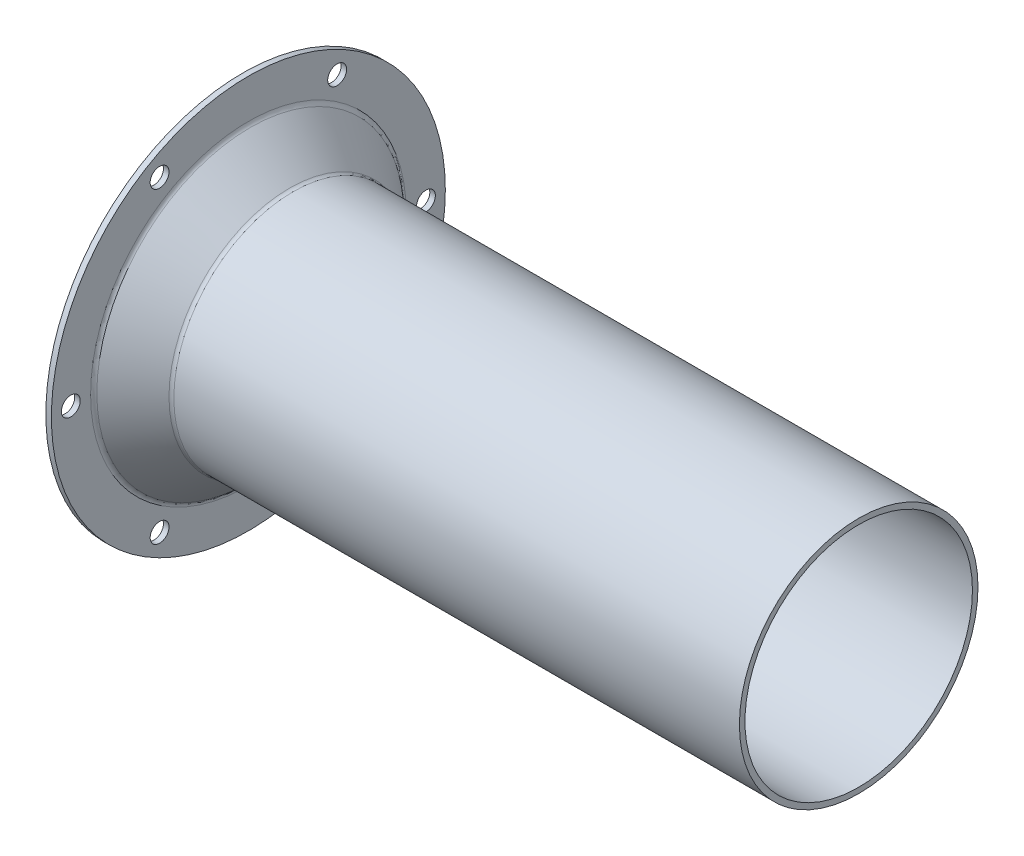
ISO-10303-21;
HEADER;
FILE_DESCRIPTION(('STEP AP214'),'2;1');
FILE_NAME('part.step','',(''),(''),'','','');
FILE_SCHEMA(('AUTOMOTIVE_DESIGN { 1 0 10303 214 1 1 1 1 }'));
ENDSEC;
DATA;
#1=APPLICATION_CONTEXT('core data for automotive mechanical design processes');
#2=APPLICATION_PROTOCOL_DEFINITION('international standard','automotive_design',2000,#1);
#3=PRODUCT_CONTEXT('',#1,'mechanical');
#4=PRODUCT('Part','Part','',(#3));
#5=PRODUCT_RELATED_PRODUCT_CATEGORY('part','',(#4));
#6=PRODUCT_DEFINITION_FORMATION('','',#4);
#7=PRODUCT_DEFINITION_CONTEXT('part definition',#1,'design');
#8=PRODUCT_DEFINITION('design','',#6,#7);
#9=PRODUCT_DEFINITION_SHAPE('','',#8);
#10=(LENGTH_UNIT() NAMED_UNIT(*) SI_UNIT(.MILLI.,.METRE.));
#11=(NAMED_UNIT(*) PLANE_ANGLE_UNIT() SI_UNIT($,.RADIAN.));
#12=(NAMED_UNIT(*) SI_UNIT($,.STERADIAN.) SOLID_ANGLE_UNIT());
#13=UNCERTAINTY_MEASURE_WITH_UNIT(LENGTH_MEASURE(1.E-05),#10,'distance_accuracy_value','');
#14=(GEOMETRIC_REPRESENTATION_CONTEXT(3) GLOBAL_UNCERTAINTY_ASSIGNED_CONTEXT((#13)) GLOBAL_UNIT_ASSIGNED_CONTEXT((#10,
#11,#12)) REPRESENTATION_CONTEXT('',''));
#15=CARTESIAN_POINT('',(0.,0.,0.));
#16=DIRECTION('',(0.,0.,1.));
#17=DIRECTION('',(1.,0.,0.));
#18=AXIS2_PLACEMENT_3D('',#15,#16,#17);
#19=CARTESIAN_POINT('',(0.,0.,0.));
#20=DIRECTION('',(1.,0.,0.));
#21=DIRECTION('',(0.,0.,-1.));
#22=AXIS2_PLACEMENT_3D('',#19,#20,#21);
#23=PLANE('',#22);
#24=CARTESIAN_POINT('',(0.,0.,0.));
#25=DIRECTION('',(-1.,0.,0.));
#26=DIRECTION('',(0.,0.,1.));
#27=AXIS2_PLACEMENT_3D('',#24,#25,#26);
#28=CIRCLE('',#27,28.43261485335);
#29=CARTESIAN_POINT('',(0.,0.,28.432614899646));
#30=VERTEX_POINT('',#29);
#31=CARTESIAN_POINT('',(0.,0.,-28.432614899646));
#32=VERTEX_POINT('',#31);
#33=EDGE_CURVE('E45',#30,#32,#28,.T.);
#34=ORIENTED_EDGE('',*,*,#33,.F.);
#35=CARTESIAN_POINT('',(0.,0.,0.));
#36=DIRECTION('',(-1.,0.,0.));
#37=DIRECTION('',(0.,0.,-1.));
#38=AXIS2_PLACEMENT_3D('',#35,#36,#37);
#39=CIRCLE('',#38,28.43261485335);
#40=EDGE_CURVE('E50',#32,#30,#39,.T.);
#41=ORIENTED_EDGE('',*,*,#40,.F.);
#42=EDGE_LOOP('',(#34,#41));
#43=FACE_BOUND('',#42,.T.);
#44=CARTESIAN_POINT('',(0.,-27.7128129211,-16.));
#45=DIRECTION('',(1.,0.,0.));
#46=DIRECTION('',(0.,0.,-1.));
#47=AXIS2_PLACEMENT_3D('',#44,#45,#46);
#48=CIRCLE('',#47,1.7);
#49=CARTESIAN_POINT('',(0.,-27.7128129211,-17.7));
#50=VERTEX_POINT('',#49);
#51=EDGE_CURVE('E83',#50,#50,#48,.T.);
#52=ORIENTED_EDGE('',*,*,#51,.T.);
#53=EDGE_LOOP('',(#52));
#54=FACE_BOUND('',#53,.T.);
#55=CARTESIAN_POINT('',(0.,0.,-32.));
#56=DIRECTION('',(1.,0.,0.));
#57=DIRECTION('',(0.,0.,-1.));
#58=AXIS2_PLACEMENT_3D('',#55,#56,#57);
#59=CIRCLE('',#58,1.7);
#60=CARTESIAN_POINT('',(0.,0.,-33.7));
#61=VERTEX_POINT('',#60);
#62=EDGE_CURVE('E231',#61,#61,#59,.T.);
#63=ORIENTED_EDGE('',*,*,#62,.T.);
#64=EDGE_LOOP('',(#63));
#65=FACE_BOUND('',#64,.T.);
#66=CARTESIAN_POINT('',(0.,-27.7128129211,16.));
#67=DIRECTION('',(1.,0.,0.));
#68=DIRECTION('',(0.,0.,-1.));
#69=AXIS2_PLACEMENT_3D('',#66,#67,#68);
#70=CIRCLE('',#69,1.7);
#71=CARTESIAN_POINT('',(0.,-27.7128129211,14.3));
#72=VERTEX_POINT('',#71);
#73=EDGE_CURVE('E234',#72,#72,#70,.T.);
#74=ORIENTED_EDGE('',*,*,#73,.T.);
#75=EDGE_LOOP('',(#74));
#76=FACE_BOUND('',#75,.T.);
#77=CARTESIAN_POINT('',(0.,0.,32.));
#78=DIRECTION('',(1.,0.,0.));
#79=DIRECTION('',(0.,0.,-1.));
#80=AXIS2_PLACEMENT_3D('',#77,#78,#79);
#81=CIRCLE('',#80,1.7);
#82=CARTESIAN_POINT('',(0.,0.,30.3));
#83=VERTEX_POINT('',#82);
#84=EDGE_CURVE('E237',#83,#83,#81,.T.);
#85=ORIENTED_EDGE('',*,*,#84,.T.);
#86=EDGE_LOOP('',(#85));
#87=FACE_BOUND('',#86,.T.);
#88=CARTESIAN_POINT('',(0.,27.7128129211,16.));
#89=DIRECTION('',(1.,0.,0.));
#90=DIRECTION('',(0.,0.,-1.));
#91=AXIS2_PLACEMENT_3D('',#88,#89,#90);
#92=CIRCLE('',#91,1.7);
#93=CARTESIAN_POINT('',(0.,27.7128129211,14.3));
#94=VERTEX_POINT('',#93);
#95=EDGE_CURVE('E240',#94,#94,#92,.T.);
#96=ORIENTED_EDGE('',*,*,#95,.T.);
#97=EDGE_LOOP('',(#96));
#98=FACE_BOUND('',#97,.T.);
#99=CARTESIAN_POINT('',(0.,27.7128129211,-16.));
#100=DIRECTION('',(1.,0.,0.));
#101=DIRECTION('',(0.,0.,-1.));
#102=AXIS2_PLACEMENT_3D('',#99,#100,#101);
#103=CIRCLE('',#102,1.7);
#104=CARTESIAN_POINT('',(0.,27.7128129211,-17.7));
#105=VERTEX_POINT('',#104);
#106=EDGE_CURVE('E243',#105,#105,#103,.T.);
#107=ORIENTED_EDGE('',*,*,#106,.T.);
#108=EDGE_LOOP('',(#107));
#109=FACE_BOUND('',#108,.T.);
#110=CARTESIAN_POINT('',(0.,0.,0.));
#111=DIRECTION('',(1.,0.,0.));
#112=DIRECTION('',(0.,0.,-1.));
#113=AXIS2_PLACEMENT_3D('',#110,#111,#112);
#114=CIRCLE('',#113,35.5);
#115=CARTESIAN_POINT('',(0.,0.,-35.5));
#116=VERTEX_POINT('',#115);
#117=EDGE_CURVE('E57',#116,#116,#114,.T.);
#118=ORIENTED_EDGE('',*,*,#117,.F.);
#119=EDGE_LOOP('',(#118));
#120=FACE_BOUND('',#119,.T.);
#121=ADVANCED_FACE('F17',(#43,#54,#65,#76,#87,#98,#109,#120),#23,.F.);
#122=CARTESIAN_POINT('',(2.,0.,0.));
#123=DIRECTION('',(1.,0.,0.));
#124=DIRECTION('',(0.,0.00616046103310393,-0.999981024179889));
#125=AXIS2_PLACEMENT_3D('',#122,#123,#124);
#126=TOROIDAL_SURFACE('',#125,28.43261531631,2.);
#127=ORIENTED_EDGE('',*,*,#33,.T.);
#128=ORIENTED_EDGE('',*,*,#40,.T.);
#129=EDGE_LOOP('',(#127,#128));
#130=FACE_BOUND('',#129,.T.);
#131=CARTESIAN_POINT('',(0.714424995261982,0.,0.));
#132=DIRECTION('',(-1.,0.,0.));
#133=DIRECTION('',(0.,0.,-1.));
#134=AXIS2_PLACEMENT_3D('',#131,#132,#133);
#135=CIRCLE('',#134,26.9005262499696);
#136=CARTESIAN_POINT('',(0.714424995261982,0.,-26.9005262499696));
#137=VERTEX_POINT('',#136);
#138=EDGE_CURVE('E79',#137,#137,#135,.F.);
#139=ORIENTED_EDGE('',*,*,#138,.T.);
#140=EDGE_LOOP('',(#139));
#141=FACE_BOUND('',#140,.T.);
#142=ADVANCED_FACE('F55',(#130,#141),#126,.T.);
#143=CARTESIAN_POINT('',(-5.55,0.,0.));
#144=DIRECTION('',(1.,0.,0.));
#145=DIRECTION('',(0.,0.,-1.));
#146=AXIS2_PLACEMENT_3D('',#143,#144,#145);
#147=CYLINDRICAL_SURFACE('',#146,35.5);
#148=CARTESIAN_POINT('',(1.,0.,0.));
#149=DIRECTION('',(1.,0.,0.));
#150=DIRECTION('',(0.,0.,-1.));
#151=AXIS2_PLACEMENT_3D('',#148,#149,#150);
#152=CIRCLE('',#151,35.5);
#153=CARTESIAN_POINT('',(1.,0.,-35.5));
#154=VERTEX_POINT('',#153);
#155=EDGE_CURVE('E82',#154,#154,#152,.T.);
#156=ORIENTED_EDGE('',*,*,#155,.F.);
#157=EDGE_LOOP('',(#156));
#158=FACE_BOUND('',#157,.T.);
#159=ORIENTED_EDGE('',*,*,#117,.T.);
#160=EDGE_LOOP('',(#159));
#161=FACE_BOUND('',#160,.T.);
#162=ADVANCED_FACE('F74',(#158,#161),#147,.T.);
#163=CARTESIAN_POINT('',(1.,27.7128129211,-16.));
#164=DIRECTION('',(1.,0.,0.));
#165=DIRECTION('',(0.,0.,-1.));
#166=AXIS2_PLACEMENT_3D('',#163,#164,#165);
#167=CYLINDRICAL_SURFACE('',#166,1.7);
#168=CARTESIAN_POINT('',(1.,27.7128129211,-16.));
#169=DIRECTION('',(1.,0.,0.));
#170=DIRECTION('',(0.,0.,-1.));
#171=AXIS2_PLACEMENT_3D('',#168,#169,#170);
#172=CIRCLE('',#171,1.7);
#173=CARTESIAN_POINT('',(1.,27.7128129211,-17.7));
#174=VERTEX_POINT('',#173);
#175=EDGE_CURVE('E224',#174,#174,#172,.F.);
#176=ORIENTED_EDGE('',*,*,#175,.F.);
#177=EDGE_LOOP('',(#176));
#178=FACE_BOUND('',#177,.T.);
#179=ORIENTED_EDGE('',*,*,#106,.F.);
#180=EDGE_LOOP('',(#179));
#181=FACE_BOUND('',#180,.T.);
#182=ADVANCED_FACE('F165',(#178,#181),#167,.F.);
#183=CARTESIAN_POINT('',(1.,27.7128129211,16.));
#184=DIRECTION('',(1.,0.,0.));
#185=DIRECTION('',(0.,0.,-1.));
#186=AXIS2_PLACEMENT_3D('',#183,#184,#185);
#187=CYLINDRICAL_SURFACE('',#186,1.7);
#188=CARTESIAN_POINT('',(1.,27.7128129211,16.));
#189=DIRECTION('',(1.,0.,0.));
#190=DIRECTION('',(0.,0.,-1.));
#191=AXIS2_PLACEMENT_3D('',#188,#189,#190);
#192=CIRCLE('',#191,1.7);
#193=CARTESIAN_POINT('',(1.,27.7128129211,14.3));
#194=VERTEX_POINT('',#193);
#195=EDGE_CURVE('E221',#194,#194,#192,.F.);
#196=ORIENTED_EDGE('',*,*,#195,.F.);
#197=EDGE_LOOP('',(#196));
#198=FACE_BOUND('',#197,.T.);
#199=ORIENTED_EDGE('',*,*,#95,.F.);
#200=EDGE_LOOP('',(#199));
#201=FACE_BOUND('',#200,.T.);
#202=ADVANCED_FACE('F162',(#198,#201),#187,.F.);
#203=CARTESIAN_POINT('',(1.,0.,32.));
#204=DIRECTION('',(1.,0.,0.));
#205=DIRECTION('',(0.,0.,-1.));
#206=AXIS2_PLACEMENT_3D('',#203,#204,#205);
#207=CYLINDRICAL_SURFACE('',#206,1.7);
#208=CARTESIAN_POINT('',(1.,0.,32.));
#209=DIRECTION('',(1.,0.,0.));
#210=DIRECTION('',(0.,0.,-1.));
#211=AXIS2_PLACEMENT_3D('',#208,#209,#210);
#212=CIRCLE('',#211,1.7);
#213=CARTESIAN_POINT('',(1.,0.,30.3));
#214=VERTEX_POINT('',#213);
#215=EDGE_CURVE('E218',#214,#214,#212,.F.);
#216=ORIENTED_EDGE('',*,*,#215,.F.);
#217=EDGE_LOOP('',(#216));
#218=FACE_BOUND('',#217,.T.);
#219=ORIENTED_EDGE('',*,*,#84,.F.);
#220=EDGE_LOOP('',(#219));
#221=FACE_BOUND('',#220,.T.);
#222=ADVANCED_FACE('F158',(#218,#221),#207,.F.);
#223=CARTESIAN_POINT('',(1.,-27.7128129211,16.));
#224=DIRECTION('',(1.,0.,0.));
#225=DIRECTION('',(0.,0.,-1.));
#226=AXIS2_PLACEMENT_3D('',#223,#224,#225);
#227=CYLINDRICAL_SURFACE('',#226,1.7);
#228=CARTESIAN_POINT('',(1.,-27.7128129211,16.));
#229=DIRECTION('',(1.,0.,0.));
#230=DIRECTION('',(0.,0.,-1.));
#231=AXIS2_PLACEMENT_3D('',#228,#229,#230);
#232=CIRCLE('',#231,1.7);
#233=CARTESIAN_POINT('',(1.,-27.7128129211,14.3));
#234=VERTEX_POINT('',#233);
#235=EDGE_CURVE('E215',#234,#234,#232,.F.);
#236=ORIENTED_EDGE('',*,*,#235,.F.);
#237=EDGE_LOOP('',(#236));
#238=FACE_BOUND('',#237,.T.);
#239=ORIENTED_EDGE('',*,*,#73,.F.);
#240=EDGE_LOOP('',(#239));
#241=FACE_BOUND('',#240,.T.);
#242=ADVANCED_FACE('F154',(#238,#241),#227,.F.);
#243=CARTESIAN_POINT('',(1.,0.,-32.));
#244=DIRECTION('',(1.,0.,0.));
#245=DIRECTION('',(0.,0.,-1.));
#246=AXIS2_PLACEMENT_3D('',#243,#244,#245);
#247=CYLINDRICAL_SURFACE('',#246,1.7);
#248=CARTESIAN_POINT('',(1.,0.,-32.));
#249=DIRECTION('',(1.,0.,0.));
#250=DIRECTION('',(0.,0.,-1.));
#251=AXIS2_PLACEMENT_3D('',#248,#249,#250);
#252=CIRCLE('',#251,1.7);
#253=CARTESIAN_POINT('',(1.,0.,-33.7));
#254=VERTEX_POINT('',#253);
#255=EDGE_CURVE('E212',#254,#254,#252,.F.);
#256=ORIENTED_EDGE('',*,*,#255,.F.);
#257=EDGE_LOOP('',(#256));
#258=FACE_BOUND('',#257,.T.);
#259=ORIENTED_EDGE('',*,*,#62,.F.);
#260=EDGE_LOOP('',(#259));
#261=FACE_BOUND('',#260,.T.);
#262=ADVANCED_FACE('F150',(#258,#261),#247,.F.);
#263=CARTESIAN_POINT('',(1.,-27.7128129211,-16.));
#264=DIRECTION('',(1.,0.,0.));
#265=DIRECTION('',(0.,0.,-1.));
#266=AXIS2_PLACEMENT_3D('',#263,#264,#265);
#267=CYLINDRICAL_SURFACE('',#266,1.7);
#268=CARTESIAN_POINT('',(1.,-27.7128129211,-16.));
#269=DIRECTION('',(1.,0.,0.));
#270=DIRECTION('',(0.,0.,-1.));
#271=AXIS2_PLACEMENT_3D('',#268,#269,#270);
#272=CIRCLE('',#271,1.7);
#273=CARTESIAN_POINT('',(1.,-27.7128129211,-17.7));
#274=VERTEX_POINT('',#273);
#275=EDGE_CURVE('E209',#274,#274,#272,.F.);
#276=ORIENTED_EDGE('',*,*,#275,.F.);
#277=EDGE_LOOP('',(#276));
#278=FACE_BOUND('',#277,.T.);
#279=ORIENTED_EDGE('',*,*,#51,.F.);
#280=EDGE_LOOP('',(#279));
#281=FACE_BOUND('',#280,.T.);
#282=ADVANCED_FACE('F146',(#278,#281),#267,.F.);
#283=CARTESIAN_POINT('',(0.714424995261982,0.,0.));
#284=DIRECTION('',(-1.,0.,0.));
#285=DIRECTION('',(0.,0.,1.));
#286=AXIS2_PLACEMENT_3D('',#283,#284,#285);
#287=CONICAL_SURFACE('',#286,26.9005262499696,0.6981317007976);
#288=ORIENTED_EDGE('',*,*,#138,.F.);
#289=EDGE_LOOP('',(#288));
#290=FACE_BOUND('',#289,.T.);
#291=CARTESIAN_POINT('',(7.78464048831248,0.,0.));
#292=DIRECTION('',(1.,0.,0.));
#293=DIRECTION('',(0.,0.00721223015591878,-0.999973991529869));
#294=AXIS2_PLACEMENT_3D('',#291,#292,#293);
#295=CIRCLE('',#294,20.9679110374094);
#296=CARTESIAN_POINT('',(7.78464048831248,0.151225400290626,-20.9673656941215));
#297=VERTEX_POINT('',#296);
#298=EDGE_CURVE('E84',#297,#297,#295,.F.);
#299=ORIENTED_EDGE('',*,*,#298,.F.);
#300=EDGE_LOOP('',(#299));
#301=FACE_BOUND('',#300,.T.);
#302=ADVANCED_FACE('F135',(#290,#301),#287,.F.);
#303=CARTESIAN_POINT('',(1.,0.,0.));
#304=DIRECTION('',(1.,0.,0.));
#305=DIRECTION('',(0.,0.,-1.));
#306=AXIS2_PLACEMENT_3D('',#303,#304,#305);
#307=PLANE('',#306);
#308=CARTESIAN_POINT('',(1.00000000000005,0.,0.));
#309=DIRECTION('',(1.,0.,0.));
#310=DIRECTION('',(0.,0.,-1.));
#311=AXIS2_PLACEMENT_3D('',#308,#309,#310);
#312=CIRCLE('',#311,28.432614995035);
#313=CARTESIAN_POINT('',(1.00000000000006,0.,28.43261480227));
#314=VERTEX_POINT('',#313);
#315=CARTESIAN_POINT('',(1.00000000000006,0.,-28.43261480227));
#316=VERTEX_POINT('',#315);
#317=EDGE_CURVE('E36',#314,#316,#312,.F.);
#318=ORIENTED_EDGE('',*,*,#317,.T.);
#319=CARTESIAN_POINT('',(1.00000000000021,0.,0.));
#320=DIRECTION('',(1.,0.,0.));
#321=DIRECTION('',(0.,0.,1.));
#322=AXIS2_PLACEMENT_3D('',#319,#320,#321);
#323=CIRCLE('',#322,28.43261467376);
#324=EDGE_CURVE('E87',#316,#314,#323,.F.);
#325=ORIENTED_EDGE('',*,*,#324,.T.);
#326=EDGE_LOOP('',(#318,#325));
#327=FACE_BOUND('',#326,.T.);
#328=ORIENTED_EDGE('',*,*,#275,.T.);
#329=EDGE_LOOP('',(#328));
#330=FACE_BOUND('',#329,.T.);
#331=ORIENTED_EDGE('',*,*,#255,.T.);
#332=EDGE_LOOP('',(#331));
#333=FACE_BOUND('',#332,.T.);
#334=ORIENTED_EDGE('',*,*,#235,.T.);
#335=EDGE_LOOP('',(#334));
#336=FACE_BOUND('',#335,.T.);
#337=ORIENTED_EDGE('',*,*,#215,.T.);
#338=EDGE_LOOP('',(#337));
#339=FACE_BOUND('',#338,.T.);
#340=ORIENTED_EDGE('',*,*,#195,.T.);
#341=EDGE_LOOP('',(#340));
#342=FACE_BOUND('',#341,.T.);
#343=ORIENTED_EDGE('',*,*,#175,.T.);
#344=EDGE_LOOP('',(#343));
#345=FACE_BOUND('',#344,.T.);
#346=ORIENTED_EDGE('',*,*,#155,.T.);
#347=EDGE_LOOP('',(#346));
#348=FACE_BOUND('',#347,.T.);
#349=ADVANCED_FACE('F126',(#327,#330,#333,#336,#339,#342,#345,#348),#307,.T.);
#350=CARTESIAN_POINT('',(9.070215616692,0.,0.));
#351=DIRECTION('',(1.,0.,0.));
#352=DIRECTION('',(0.,0.00721223015591877,-0.999973991529869));
#353=AXIS2_PLACEMENT_3D('',#350,#351,#352);
#354=TOROIDAL_SURFACE('',#353,22.5,2.);
#355=ORIENTED_EDGE('',*,*,#298,.T.);
#356=EDGE_LOOP('',(#355));
#357=FACE_BOUND('',#356,.T.);
#358=CARTESIAN_POINT('',(9.070215616692,0.,0.));
#359=DIRECTION('',(1.,0.,0.));
#360=DIRECTION('',(0.,0.,-1.));
#361=AXIS2_PLACEMENT_3D('',#358,#359,#360);
#362=CIRCLE('',#361,20.5);
#363=CARTESIAN_POINT('',(9.070215616692,0.,-20.5));
#364=VERTEX_POINT('',#363);
#365=EDGE_CURVE('E119',#364,#364,#362,.T.);
#366=ORIENTED_EDGE('',*,*,#365,.T.);
#367=EDGE_LOOP('',(#366));
#368=FACE_BOUND('',#367,.T.);
#369=ADVANCED_FACE('F105',(#357,#368),#354,.T.);
#370=CARTESIAN_POINT('',(2.,0.,0.));
#371=DIRECTION('',(1.,0.,0.));
#372=DIRECTION('',(0.,-0.00621704011097389,-0.999980674019382));
#373=AXIS2_PLACEMENT_3D('',#370,#371,#372);
#374=TOROIDAL_SURFACE('',#373,28.43261531631,1.);
#375=CARTESIAN_POINT('',(1.35721269709009,0.,0.));
#376=DIRECTION('',(-1.,0.,0.));
#377=DIRECTION('',(0.,0.,-1.));
#378=AXIS2_PLACEMENT_3D('',#375,#376,#377);
#379=CIRCLE('',#378,27.6665706157689);
#380=CARTESIAN_POINT('',(1.35721269709009,0.,-27.6665706157689));
#381=VERTEX_POINT('',#380);
#382=EDGE_CURVE('E114',#381,#381,#379,.F.);
#383=ORIENTED_EDGE('',*,*,#382,.F.);
#384=EDGE_LOOP('',(#383));
#385=FACE_BOUND('',#384,.T.);
#386=ORIENTED_EDGE('',*,*,#324,.F.);
#387=ORIENTED_EDGE('',*,*,#317,.F.);
#388=EDGE_LOOP('',(#386,#387));
#389=FACE_BOUND('',#388,.T.);
#390=ADVANCED_FACE('F93',(#385,#389),#374,.F.);
#391=CARTESIAN_POINT('',(-5.55,0.,0.));
#392=DIRECTION('',(1.,0.,0.));
#393=DIRECTION('',(0.,0.,-1.));
#394=AXIS2_PLACEMENT_3D('',#391,#392,#393);
#395=CYLINDRICAL_SURFACE('',#394,20.5);
#396=CARTESIAN_POINT('',(111.,0.,0.));
#397=DIRECTION('',(1.,0.,0.));
#398=DIRECTION('',(0.,0.,-1.));
#399=AXIS2_PLACEMENT_3D('',#396,#397,#398);
#400=CIRCLE('',#399,20.5);
#401=CARTESIAN_POINT('',(111.,0.,-20.5));
#402=VERTEX_POINT('',#401);
#403=EDGE_CURVE('E118',#402,#402,#400,.F.);
#404=ORIENTED_EDGE('',*,*,#403,.F.);
#405=EDGE_LOOP('',(#404));
#406=FACE_BOUND('',#405,.T.);
#407=ORIENTED_EDGE('',*,*,#365,.F.);
#408=EDGE_LOOP('',(#407));
#409=FACE_BOUND('',#408,.T.);
#410=ADVANCED_FACE('F104',(#406,#409),#395,.F.);
#411=CARTESIAN_POINT('',(1.35721269709009,0.,0.));
#412=DIRECTION('',(-1.,0.,0.));
#413=DIRECTION('',(0.,0.,1.));
#414=AXIS2_PLACEMENT_3D('',#411,#412,#413);
#415=CONICAL_SURFACE('',#414,27.6665706157689,0.6981317007976);
#416=ORIENTED_EDGE('',*,*,#382,.T.);
#417=EDGE_LOOP('',(#416));
#418=FACE_BOUND('',#417,.T.);
#419=CARTESIAN_POINT('',(8.42742826138858,0.,0.));
#420=DIRECTION('',(1.,0.,0.));
#421=DIRECTION('',(0.,-0.00651687448335113,-0.99997876494802));
#422=AXIS2_PLACEMENT_3D('',#419,#420,#421);
#423=CIRCLE('',#422,21.7339553434283);
#424=CARTESIAN_POINT('',(8.42742826138858,-0.141637458999881,-21.7334938217569));
#425=VERTEX_POINT('',#424);
#426=EDGE_CURVE('E115',#425,#425,#423,.F.);
#427=ORIENTED_EDGE('',*,*,#426,.T.);
#428=EDGE_LOOP('',(#427));
#429=FACE_BOUND('',#428,.T.);
#430=ADVANCED_FACE('F193',(#418,#429),#415,.T.);
#431=CARTESIAN_POINT('',(111.,0.,0.));
#432=DIRECTION('',(1.,0.,0.));
#433=DIRECTION('',(0.,0.,-1.));
#434=AXIS2_PLACEMENT_3D('',#431,#432,#433);
#435=PLANE('',#434);
#436=ORIENTED_EDGE('',*,*,#403,.T.);
#437=EDGE_LOOP('',(#436));
#438=FACE_BOUND('',#437,.T.);
#439=CARTESIAN_POINT('',(111.,0.,0.));
#440=DIRECTION('',(1.,0.,0.));
#441=DIRECTION('',(0.,0.,-1.));
#442=AXIS2_PLACEMENT_3D('',#439,#440,#441);
#443=CIRCLE('',#442,21.5);
#444=CARTESIAN_POINT('',(111.,0.,-21.5));
#445=VERTEX_POINT('',#444);
#446=EDGE_CURVE('E28',#445,#445,#443,.F.);
#447=ORIENTED_EDGE('',*,*,#446,.F.);
#448=EDGE_LOOP('',(#447));
#449=FACE_BOUND('',#448,.T.);
#450=ADVANCED_FACE('F184',(#438,#449),#435,.T.);
#451=CARTESIAN_POINT('',(9.070215616692,0.,0.));
#452=DIRECTION('',(1.,0.,0.));
#453=DIRECTION('',(0.,-0.00651687448335113,-0.99997876494802));
#454=AXIS2_PLACEMENT_3D('',#451,#452,#453);
#455=TOROIDAL_SURFACE('',#454,22.5,1.);
#456=CARTESIAN_POINT('',(9.070215616692,0.,0.));
#457=DIRECTION('',(1.,0.,0.));
#458=DIRECTION('',(0.,0.,-1.));
#459=AXIS2_PLACEMENT_3D('',#456,#457,#458);
#460=CIRCLE('',#459,21.5);
#461=CARTESIAN_POINT('',(9.070215616692,0.,-21.5));
#462=VERTEX_POINT('',#461);
#463=EDGE_CURVE('E11',#462,#462,#460,.T.);
#464=ORIENTED_EDGE('',*,*,#463,.F.);
#465=EDGE_LOOP('',(#464));
#466=FACE_BOUND('',#465,.T.);
#467=ORIENTED_EDGE('',*,*,#426,.F.);
#468=EDGE_LOOP('',(#467));
#469=FACE_BOUND('',#468,.T.);
#470=ADVANCED_FACE('F178',(#466,#469),#455,.F.);
#471=CARTESIAN_POINT('',(-5.55,0.,0.));
#472=DIRECTION('',(1.,0.,0.));
#473=DIRECTION('',(0.,0.,-1.));
#474=AXIS2_PLACEMENT_3D('',#471,#472,#473);
#475=CYLINDRICAL_SURFACE('',#474,21.5);
#476=ORIENTED_EDGE('',*,*,#446,.T.);
#477=EDGE_LOOP('',(#476));
#478=FACE_BOUND('',#477,.T.);
#479=ORIENTED_EDGE('',*,*,#463,.T.);
#480=EDGE_LOOP('',(#479));
#481=FACE_BOUND('',#480,.T.);
#482=ADVANCED_FACE('F176',(#478,#481),#475,.T.);
#483=CLOSED_SHELL('',(#121,#142,#162,#182,#202,#222,#242,#262,#282,#302,#349,#369,#390,#410,
#430,#450,#470,#482));
#484=MANIFOLD_SOLID_BREP('B1',#483);
#485=ADVANCED_BREP_SHAPE_REPRESENTATION('',(#18,#484),#14);
#486=SHAPE_DEFINITION_REPRESENTATION(#9,#485);
ENDSEC;
END-ISO-10303-21;
